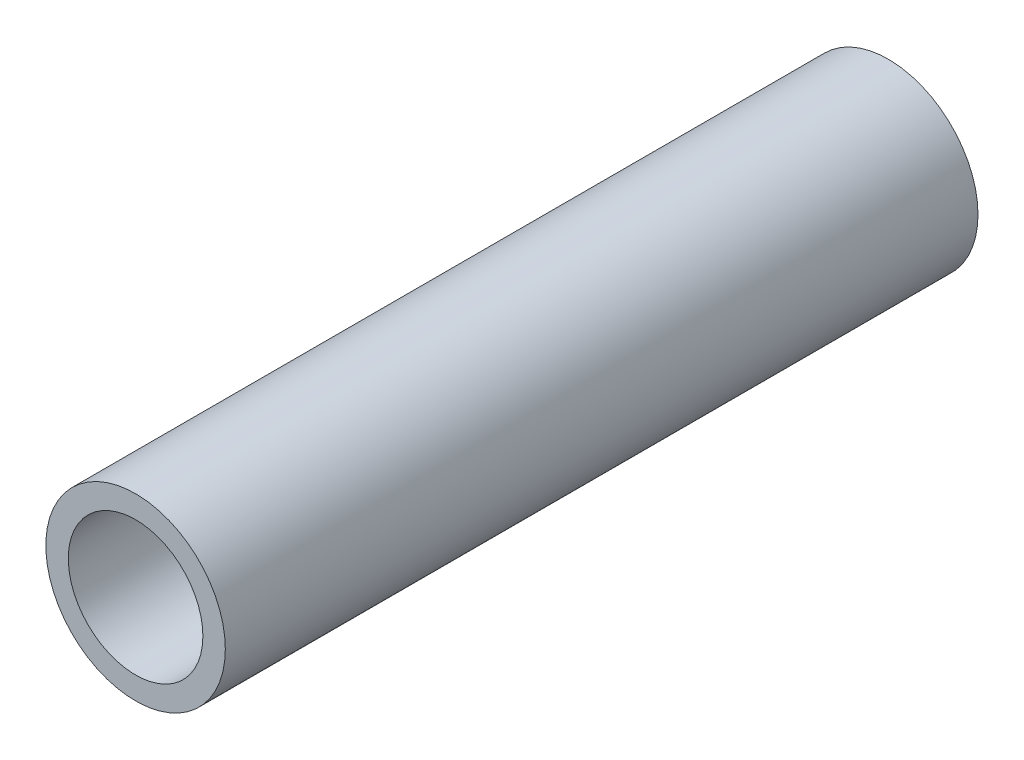
ISO-10303-21;
HEADER;
FILE_DESCRIPTION(('STEP AP214'),'2;1');
FILE_NAME('part.step','',(''),(''),'','','');
FILE_SCHEMA(('AUTOMOTIVE_DESIGN { 1 0 10303 214 1 1 1 1 }'));
ENDSEC;
DATA;
#1=APPLICATION_CONTEXT('core data for automotive mechanical design processes');
#2=APPLICATION_PROTOCOL_DEFINITION('international standard','automotive_design',2000,#1);
#3=PRODUCT_CONTEXT('',#1,'mechanical');
#4=PRODUCT('Part','Part','',(#3));
#5=PRODUCT_RELATED_PRODUCT_CATEGORY('part','',(#4));
#6=PRODUCT_DEFINITION_FORMATION('','',#4);
#7=PRODUCT_DEFINITION_CONTEXT('part definition',#1,'design');
#8=PRODUCT_DEFINITION('design','',#6,#7);
#9=PRODUCT_DEFINITION_SHAPE('','',#8);
#10=(LENGTH_UNIT() NAMED_UNIT(*) SI_UNIT(.MILLI.,.METRE.));
#11=(NAMED_UNIT(*) PLANE_ANGLE_UNIT() SI_UNIT($,.RADIAN.));
#12=(NAMED_UNIT(*) SI_UNIT($,.STERADIAN.) SOLID_ANGLE_UNIT());
#13=UNCERTAINTY_MEASURE_WITH_UNIT(LENGTH_MEASURE(1.E-05),#10,'distance_accuracy_value','');
#14=(GEOMETRIC_REPRESENTATION_CONTEXT(3) GLOBAL_UNCERTAINTY_ASSIGNED_CONTEXT((#13)) GLOBAL_UNIT_ASSIGNED_CONTEXT((#10,
#11,#12)) REPRESENTATION_CONTEXT('',''));
#15=CARTESIAN_POINT('',(0.,0.,0.));
#16=DIRECTION('',(0.,0.,1.));
#17=DIRECTION('',(1.,0.,0.));
#18=AXIS2_PLACEMENT_3D('',#15,#16,#17);
#19=CARTESIAN_POINT('',(0.,0.,33.55));
#20=DIRECTION('',(0.,0.,1.));
#21=DIRECTION('',(1.,0.,0.));
#22=AXIS2_PLACEMENT_3D('',#19,#20,#21);
#23=PLANE('',#22);
#24=CARTESIAN_POINT('',(0.,0.,33.55));
#25=DIRECTION('',(0.,0.,1.));
#26=DIRECTION('',(1.,0.,0.));
#27=AXIS2_PLACEMENT_3D('',#24,#25,#26);
#28=CIRCLE('',#27,4.);
#29=CARTESIAN_POINT('',(4.,0.,33.55));
#30=VERTEX_POINT('',#29);
#31=EDGE_CURVE('E10',#30,#30,#28,.T.);
#32=ORIENTED_EDGE('',*,*,#31,.T.);
#33=EDGE_LOOP('',(#32));
#34=FACE_BOUND('',#33,.T.);
#35=CARTESIAN_POINT('',(0.,0.,33.55));
#36=DIRECTION('',(0.,0.,1.));
#37=DIRECTION('',(1.,0.,0.));
#38=AXIS2_PLACEMENT_3D('',#35,#36,#37);
#39=CIRCLE('',#38,3.);
#40=CARTESIAN_POINT('',(3.,0.,33.55));
#41=VERTEX_POINT('',#40);
#42=EDGE_CURVE('E48',#41,#41,#39,.T.);
#43=ORIENTED_EDGE('',*,*,#42,.F.);
#44=EDGE_LOOP('',(#43));
#45=FACE_BOUND('',#44,.T.);
#46=ADVANCED_FACE('F34',(#34,#45),#23,.T.);
#47=CARTESIAN_POINT('',(0.,0.,0.));
#48=DIRECTION('',(0.,0.,1.));
#49=DIRECTION('',(1.,0.,0.));
#50=AXIS2_PLACEMENT_3D('',#47,#48,#49);
#51=PLANE('',#50);
#52=CARTESIAN_POINT('',(0.,0.,0.));
#53=DIRECTION('',(0.,0.,1.));
#54=DIRECTION('',(1.,0.,0.));
#55=AXIS2_PLACEMENT_3D('',#52,#53,#54);
#56=CIRCLE('',#55,4.);
#57=CARTESIAN_POINT('',(4.,0.,0.));
#58=VERTEX_POINT('',#57);
#59=EDGE_CURVE('E38',#58,#58,#56,.T.);
#60=ORIENTED_EDGE('',*,*,#59,.F.);
#61=EDGE_LOOP('',(#60));
#62=FACE_BOUND('',#61,.T.);
#63=CARTESIAN_POINT('',(0.,0.,0.));
#64=DIRECTION('',(0.,0.,1.));
#65=DIRECTION('',(1.,0.,0.));
#66=AXIS2_PLACEMENT_3D('',#63,#64,#65);
#67=CIRCLE('',#66,3.);
#68=CARTESIAN_POINT('',(3.,0.,0.));
#69=VERTEX_POINT('',#68);
#70=EDGE_CURVE('E50',#69,#69,#67,.T.);
#71=ORIENTED_EDGE('',*,*,#70,.T.);
#72=EDGE_LOOP('',(#71));
#73=FACE_BOUND('',#72,.T.);
#74=ADVANCED_FACE('F61',(#62,#73),#51,.F.);
#75=CARTESIAN_POINT('',(0.,0.,33.55));
#76=DIRECTION('',(0.,0.,-1.));
#77=DIRECTION('',(-1.,0.,0.));
#78=AXIS2_PLACEMENT_3D('',#75,#76,#77);
#79=CYLINDRICAL_SURFACE('',#78,4.);
#80=ORIENTED_EDGE('',*,*,#31,.F.);
#81=EDGE_LOOP('',(#80));
#82=FACE_BOUND('',#81,.T.);
#83=ORIENTED_EDGE('',*,*,#59,.T.);
#84=EDGE_LOOP('',(#83));
#85=FACE_BOUND('',#84,.T.);
#86=ADVANCED_FACE('F36',(#82,#85),#79,.T.);
#87=CARTESIAN_POINT('',(0.,0.,33.55));
#88=DIRECTION('',(0.,0.,-1.));
#89=DIRECTION('',(-1.,0.,0.));
#90=AXIS2_PLACEMENT_3D('',#87,#88,#89);
#91=CYLINDRICAL_SURFACE('',#90,3.);
#92=ORIENTED_EDGE('',*,*,#42,.T.);
#93=EDGE_LOOP('',(#92));
#94=FACE_BOUND('',#93,.T.);
#95=ORIENTED_EDGE('',*,*,#70,.F.);
#96=EDGE_LOOP('',(#95));
#97=FACE_BOUND('',#96,.T.);
#98=ADVANCED_FACE('F57',(#94,#97),#91,.F.);
#99=CLOSED_SHELL('',(#46,#74,#86,#98));
#100=MANIFOLD_SOLID_BREP('B2',#99);
#101=ADVANCED_BREP_SHAPE_REPRESENTATION('',(#18,#100),#14);
#102=SHAPE_DEFINITION_REPRESENTATION(#9,#101);
ENDSEC;
END-ISO-10303-21;
